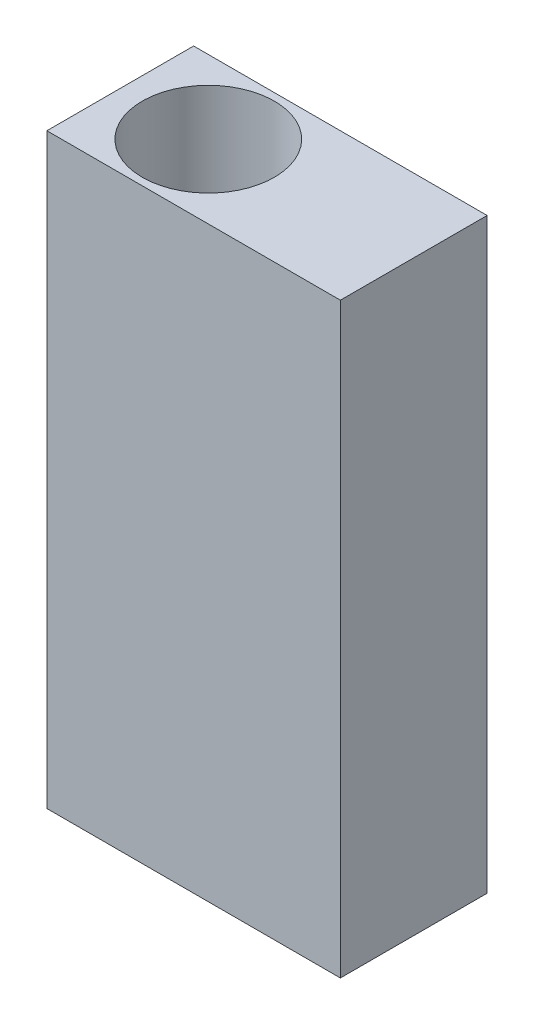
ISO-10303-21;
HEADER;
FILE_DESCRIPTION(('STEP AP214'),'2;1');
FILE_NAME('part.step','',(''),(''),'','','');
FILE_SCHEMA(('AUTOMOTIVE_DESIGN { 1 0 10303 214 1 1 1 1 }'));
ENDSEC;
DATA;
#1=APPLICATION_CONTEXT('core data for automotive mechanical design processes');
#2=APPLICATION_PROTOCOL_DEFINITION('international standard','automotive_design',2000,#1);
#3=PRODUCT_CONTEXT('',#1,'mechanical');
#4=PRODUCT('Part','Part','',(#3));
#5=PRODUCT_RELATED_PRODUCT_CATEGORY('part','',(#4));
#6=PRODUCT_DEFINITION_FORMATION('','',#4);
#7=PRODUCT_DEFINITION_CONTEXT('part definition',#1,'design');
#8=PRODUCT_DEFINITION('design','',#6,#7);
#9=PRODUCT_DEFINITION_SHAPE('','',#8);
#10=(LENGTH_UNIT() NAMED_UNIT(*) SI_UNIT(.MILLI.,.METRE.));
#11=(NAMED_UNIT(*) PLANE_ANGLE_UNIT() SI_UNIT($,.RADIAN.));
#12=(NAMED_UNIT(*) SI_UNIT($,.STERADIAN.) SOLID_ANGLE_UNIT());
#13=UNCERTAINTY_MEASURE_WITH_UNIT(LENGTH_MEASURE(1.E-05),#10,'distance_accuracy_value','');
#14=(GEOMETRIC_REPRESENTATION_CONTEXT(3) GLOBAL_UNCERTAINTY_ASSIGNED_CONTEXT((#13)) GLOBAL_UNIT_ASSIGNED_CONTEXT((#10,
#11,#12)) REPRESENTATION_CONTEXT('',''));
#15=CARTESIAN_POINT('',(0.,0.,0.));
#16=DIRECTION('',(0.,0.,1.));
#17=DIRECTION('',(1.,0.,0.));
#18=AXIS2_PLACEMENT_3D('',#15,#16,#17);
#19=CARTESIAN_POINT('',(0.,40.,0.));
#20=DIRECTION('',(0.,1.,0.));
#21=DIRECTION('',(0.,0.,1.));
#22=AXIS2_PLACEMENT_3D('',#19,#20,#21);
#23=PLANE('',#22);
#24=DIRECTION('',(0.,0.,1.));
#25=VECTOR('',#24,1.);
#26=CARTESIAN_POINT('',(-6.,40.,-5.));
#27=LINE('',#26,#25);
#28=CARTESIAN_POINT('',(-6.,40.,-5.));
#29=VERTEX_POINT('',#28);
#30=CARTESIAN_POINT('',(-6.,40.,5.));
#31=VERTEX_POINT('',#30);
#32=EDGE_CURVE('E85',#29,#31,#27,.T.);
#33=ORIENTED_EDGE('',*,*,#32,.T.);
#34=DIRECTION('',(1.,0.,0.));
#35=VECTOR('',#34,1.);
#36=CARTESIAN_POINT('',(-6.,40.,5.));
#37=LINE('',#36,#35);
#38=CARTESIAN_POINT('',(14.,40.,5.));
#39=VERTEX_POINT('',#38);
#40=EDGE_CURVE('E80',#31,#39,#37,.T.);
#41=ORIENTED_EDGE('',*,*,#40,.T.);
#42=DIRECTION('',(0.,0.,-1.));
#43=VECTOR('',#42,1.);
#44=CARTESIAN_POINT('',(14.,40.,-5.));
#45=LINE('',#44,#43);
#46=CARTESIAN_POINT('',(14.,40.,-5.));
#47=VERTEX_POINT('',#46);
#48=EDGE_CURVE('E83',#39,#47,#45,.T.);
#49=ORIENTED_EDGE('',*,*,#48,.T.);
#50=DIRECTION('',(-1.,0.,0.));
#51=VECTOR('',#50,1.);
#52=CARTESIAN_POINT('',(-6.,40.,-5.));
#53=LINE('',#52,#51);
#54=EDGE_CURVE('E50',#47,#29,#53,.T.);
#55=ORIENTED_EDGE('',*,*,#54,.T.);
#56=EDGE_LOOP('',(#33,#41,#49,#55));
#57=FACE_BOUND('',#56,.T.);
#58=CARTESIAN_POINT('',(0.,40.,0.));
#59=DIRECTION('',(0.,1.,0.));
#60=DIRECTION('',(0.,0.,1.));
#61=AXIS2_PLACEMENT_3D('',#58,#59,#60);
#62=CIRCLE('',#61,4.5);
#63=CARTESIAN_POINT('',(0.,40.,4.5));
#64=VERTEX_POINT('',#63);
#65=EDGE_CURVE('E100',#64,#64,#62,.T.);
#66=ORIENTED_EDGE('',*,*,#65,.F.);
#67=EDGE_LOOP('',(#66));
#68=FACE_BOUND('',#67,.T.);
#69=ADVANCED_FACE('F33',(#57,#68),#23,.T.);
#70=CARTESIAN_POINT('',(0.,0.,0.));
#71=DIRECTION('',(0.,1.,0.));
#72=DIRECTION('',(0.,0.,1.));
#73=AXIS2_PLACEMENT_3D('',#70,#71,#72);
#74=PLANE('',#73);
#75=DIRECTION('',(0.,0.,1.));
#76=VECTOR('',#75,1.);
#77=CARTESIAN_POINT('',(-6.,0.,-5.));
#78=LINE('',#77,#76);
#79=CARTESIAN_POINT('',(-6.,0.,-5.));
#80=VERTEX_POINT('',#79);
#81=CARTESIAN_POINT('',(-6.,0.,5.));
#82=VERTEX_POINT('',#81);
#83=EDGE_CURVE('E97',#80,#82,#78,.T.);
#84=ORIENTED_EDGE('',*,*,#83,.F.);
#85=DIRECTION('',(-1.,0.,0.));
#86=VECTOR('',#85,1.);
#87=CARTESIAN_POINT('',(-6.,0.,-5.));
#88=LINE('',#87,#86);
#89=CARTESIAN_POINT('',(14.,0.,-5.));
#90=VERTEX_POINT('',#89);
#91=EDGE_CURVE('E73',#90,#80,#88,.T.);
#92=ORIENTED_EDGE('',*,*,#91,.F.);
#93=DIRECTION('',(0.,0.,-1.));
#94=VECTOR('',#93,1.);
#95=CARTESIAN_POINT('',(14.,0.,-5.));
#96=LINE('',#95,#94);
#97=CARTESIAN_POINT('',(14.,0.,5.));
#98=VERTEX_POINT('',#97);
#99=EDGE_CURVE('E67',#98,#90,#96,.T.);
#100=ORIENTED_EDGE('',*,*,#99,.F.);
#101=DIRECTION('',(1.,0.,0.));
#102=VECTOR('',#101,1.);
#103=CARTESIAN_POINT('',(-6.,0.,5.));
#104=LINE('',#103,#102);
#105=EDGE_CURVE('E89',#82,#98,#104,.T.);
#106=ORIENTED_EDGE('',*,*,#105,.F.);
#107=EDGE_LOOP('',(#84,#92,#100,#106));
#108=FACE_BOUND('',#107,.T.);
#109=CARTESIAN_POINT('',(0.,0.,0.));
#110=DIRECTION('',(0.,1.,0.));
#111=DIRECTION('',(0.,0.,1.));
#112=AXIS2_PLACEMENT_3D('',#109,#110,#111);
#113=CIRCLE('',#112,4.5);
#114=CARTESIAN_POINT('',(0.,0.,4.5));
#115=VERTEX_POINT('',#114);
#116=EDGE_CURVE('E112',#115,#115,#113,.T.);
#117=ORIENTED_EDGE('',*,*,#116,.T.);
#118=EDGE_LOOP('',(#117));
#119=FACE_BOUND('',#118,.T.);
#120=ADVANCED_FACE('F108',(#108,#119),#74,.F.);
#121=CARTESIAN_POINT('',(-6.,40.,-5.));
#122=DIRECTION('',(1.,0.,0.));
#123=DIRECTION('',(0.,0.,-1.));
#124=AXIS2_PLACEMENT_3D('',#121,#122,#123);
#125=PLANE('',#124);
#126=ORIENTED_EDGE('',*,*,#83,.T.);
#127=DIRECTION('',(0.,-1.,0.));
#128=VECTOR('',#127,1.);
#129=CARTESIAN_POINT('',(-6.,40.,5.));
#130=LINE('',#129,#128);
#131=EDGE_CURVE('E11',#31,#82,#130,.T.);
#132=ORIENTED_EDGE('',*,*,#131,.F.);
#133=ORIENTED_EDGE('',*,*,#32,.F.);
#134=DIRECTION('',(0.,-1.,0.));
#135=VECTOR('',#134,1.);
#136=CARTESIAN_POINT('',(-6.,40.,-5.));
#137=LINE('',#136,#135);
#138=EDGE_CURVE('E93',#29,#80,#137,.T.);
#139=ORIENTED_EDGE('',*,*,#138,.T.);
#140=EDGE_LOOP('',(#126,#132,#133,#139));
#141=FACE_BOUND('',#140,.T.);
#142=ADVANCED_FACE('F35',(#141),#125,.F.);
#143=CARTESIAN_POINT('',(-6.,40.,5.));
#144=DIRECTION('',(0.,0.,-1.));
#145=DIRECTION('',(-1.,0.,0.));
#146=AXIS2_PLACEMENT_3D('',#143,#144,#145);
#147=PLANE('',#146);
#148=ORIENTED_EDGE('',*,*,#105,.T.);
#149=DIRECTION('',(0.,-1.,0.));
#150=VECTOR('',#149,1.);
#151=CARTESIAN_POINT('',(14.,40.,5.));
#152=LINE('',#151,#150);
#153=EDGE_CURVE('E42',#39,#98,#152,.T.);
#154=ORIENTED_EDGE('',*,*,#153,.F.);
#155=ORIENTED_EDGE('',*,*,#40,.F.);
#156=ORIENTED_EDGE('',*,*,#131,.T.);
#157=EDGE_LOOP('',(#148,#154,#155,#156));
#158=FACE_BOUND('',#157,.T.);
#159=ADVANCED_FACE('F88',(#158),#147,.F.);
#160=CARTESIAN_POINT('',(14.,40.,-5.));
#161=DIRECTION('',(-1.,0.,0.));
#162=DIRECTION('',(0.,0.,1.));
#163=AXIS2_PLACEMENT_3D('',#160,#161,#162);
#164=PLANE('',#163);
#165=ORIENTED_EDGE('',*,*,#99,.T.);
#166=DIRECTION('',(0.,-1.,0.));
#167=VECTOR('',#166,1.);
#168=CARTESIAN_POINT('',(14.,40.,-5.));
#169=LINE('',#168,#167);
#170=EDGE_CURVE('E90',#47,#90,#169,.T.);
#171=ORIENTED_EDGE('',*,*,#170,.F.);
#172=ORIENTED_EDGE('',*,*,#48,.F.);
#173=ORIENTED_EDGE('',*,*,#153,.T.);
#174=EDGE_LOOP('',(#165,#171,#172,#173));
#175=FACE_BOUND('',#174,.T.);
#176=ADVANCED_FACE('F91',(#175),#164,.F.);
#177=CARTESIAN_POINT('',(-6.,40.,-5.));
#178=DIRECTION('',(0.,0.,1.));
#179=DIRECTION('',(1.,0.,0.));
#180=AXIS2_PLACEMENT_3D('',#177,#178,#179);
#181=PLANE('',#180);
#182=ORIENTED_EDGE('',*,*,#91,.T.);
#183=ORIENTED_EDGE('',*,*,#138,.F.);
#184=ORIENTED_EDGE('',*,*,#54,.F.);
#185=ORIENTED_EDGE('',*,*,#170,.T.);
#186=EDGE_LOOP('',(#182,#183,#184,#185));
#187=FACE_BOUND('',#186,.T.);
#188=ADVANCED_FACE('F105',(#187),#181,.F.);
#189=CARTESIAN_POINT('',(0.,40.,0.));
#190=DIRECTION('',(0.,-1.,0.));
#191=DIRECTION('',(0.,0.,-1.));
#192=AXIS2_PLACEMENT_3D('',#189,#190,#191);
#193=CYLINDRICAL_SURFACE('',#192,4.5);
#194=ORIENTED_EDGE('',*,*,#65,.T.);
#195=EDGE_LOOP('',(#194));
#196=FACE_BOUND('',#195,.T.);
#197=ORIENTED_EDGE('',*,*,#116,.F.);
#198=EDGE_LOOP('',(#197));
#199=FACE_BOUND('',#198,.T.);
#200=ADVANCED_FACE('F118',(#196,#199),#193,.F.);
#201=CLOSED_SHELL('',(#69,#120,#142,#159,#176,#188,#200));
#202=MANIFOLD_SOLID_BREP('B2',#201);
#203=ADVANCED_BREP_SHAPE_REPRESENTATION('',(#18,#202),#14);
#204=SHAPE_DEFINITION_REPRESENTATION(#9,#203);
ENDSEC;
END-ISO-10303-21;
